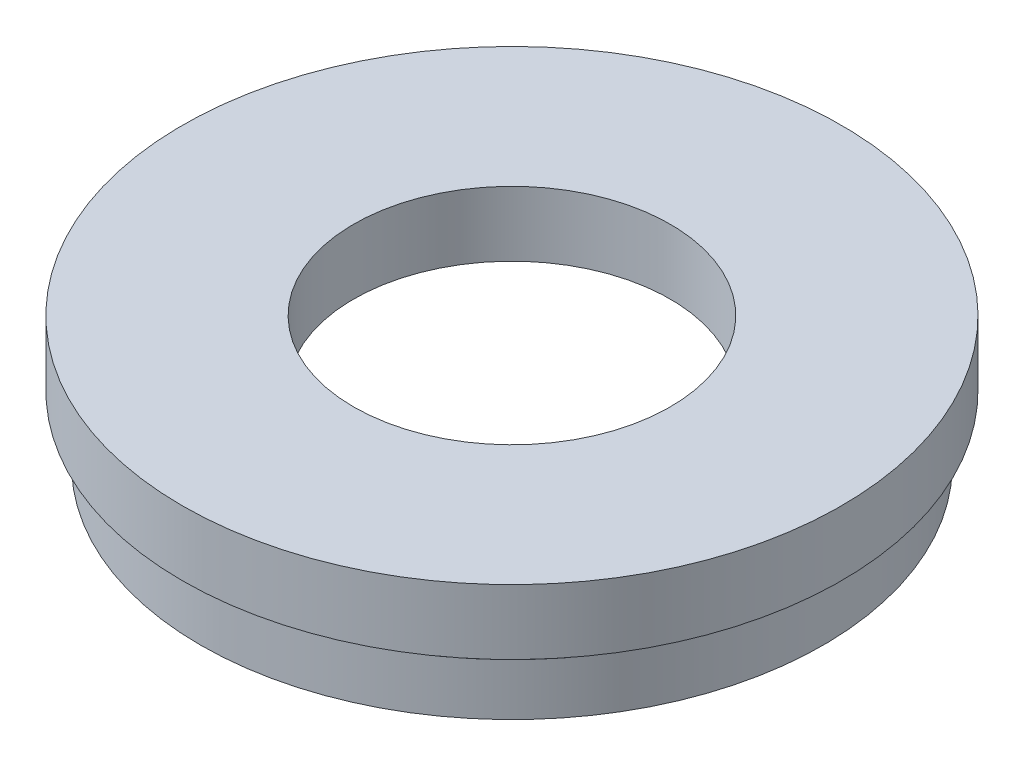
ISO-10303-21;
HEADER;
FILE_DESCRIPTION(('STEP AP214'),'2;1');
FILE_NAME('part.step','',(''),(''),'','','');
FILE_SCHEMA(('AUTOMOTIVE_DESIGN { 1 0 10303 214 1 1 1 1 }'));
ENDSEC;
DATA;
#1=APPLICATION_CONTEXT('core data for automotive mechanical design processes');
#2=APPLICATION_PROTOCOL_DEFINITION('international standard','automotive_design',2000,#1);
#3=PRODUCT_CONTEXT('',#1,'mechanical');
#4=PRODUCT('Part','Part','',(#3));
#5=PRODUCT_RELATED_PRODUCT_CATEGORY('part','',(#4));
#6=PRODUCT_DEFINITION_FORMATION('','',#4);
#7=PRODUCT_DEFINITION_CONTEXT('part definition',#1,'design');
#8=PRODUCT_DEFINITION('design','',#6,#7);
#9=PRODUCT_DEFINITION_SHAPE('','',#8);
#10=(LENGTH_UNIT() NAMED_UNIT(*) SI_UNIT(.MILLI.,.METRE.));
#11=(NAMED_UNIT(*) PLANE_ANGLE_UNIT() SI_UNIT($,.RADIAN.));
#12=(NAMED_UNIT(*) SI_UNIT($,.STERADIAN.) SOLID_ANGLE_UNIT());
#13=UNCERTAINTY_MEASURE_WITH_UNIT(LENGTH_MEASURE(1.E-05),#10,'distance_accuracy_value','');
#14=(GEOMETRIC_REPRESENTATION_CONTEXT(3) GLOBAL_UNCERTAINTY_ASSIGNED_CONTEXT((#13)) GLOBAL_UNIT_ASSIGNED_CONTEXT((#10,
#11,#12)) REPRESENTATION_CONTEXT('',''));
#15=CARTESIAN_POINT('',(0.,0.,0.));
#16=DIRECTION('',(0.,0.,1.));
#17=DIRECTION('',(1.,0.,0.));
#18=AXIS2_PLACEMENT_3D('',#15,#16,#17);
#19=CARTESIAN_POINT('',(20.5,0.,0.));
#20=DIRECTION('',(0.,1.,0.));
#21=DIRECTION('',(0.,0.,1.));
#22=AXIS2_PLACEMENT_3D('',#19,#20,#21);
#23=PLANE('',#22);
#24=CARTESIAN_POINT('',(0.,0.,0.));
#25=DIRECTION('',(0.,1.,0.));
#26=DIRECTION('',(0.,0.,1.));
#27=AXIS2_PLACEMENT_3D('',#24,#25,#26);
#28=CIRCLE('',#27,24.);
#29=CARTESIAN_POINT('',(0.,0.,24.));
#30=VERTEX_POINT('',#29);
#31=EDGE_CURVE('E10',#30,#30,#28,.T.);
#32=ORIENTED_EDGE('',*,*,#31,.F.);
#33=EDGE_LOOP('',(#32));
#34=FACE_BOUND('',#33,.T.);
#35=CARTESIAN_POINT('',(0.,0.,0.));
#36=DIRECTION('',(0.,1.,0.));
#37=DIRECTION('',(0.,0.,1.));
#38=AXIS2_PLACEMENT_3D('',#35,#36,#37);
#39=CIRCLE('',#38,20.5);
#40=CARTESIAN_POINT('',(0.,0.,20.5));
#41=VERTEX_POINT('',#40);
#42=EDGE_CURVE('E73',#41,#41,#39,.T.);
#43=ORIENTED_EDGE('',*,*,#42,.T.);
#44=EDGE_LOOP('',(#43));
#45=FACE_BOUND('',#44,.T.);
#46=ADVANCED_FACE('F33',(#34,#45),#23,.F.);
#47=CARTESIAN_POINT('',(0.,17.4192983181939,0.));
#48=DIRECTION('',(0.,1.,0.));
#49=DIRECTION('',(0.,0.,1.));
#50=AXIS2_PLACEMENT_3D('',#47,#48,#49);
#51=CYLINDRICAL_SURFACE('',#50,24.);
#52=CARTESIAN_POINT('',(0.,4.,0.));
#53=DIRECTION('',(0.,1.,0.));
#54=DIRECTION('',(0.,0.,1.));
#55=AXIS2_PLACEMENT_3D('',#52,#53,#54);
#56=CIRCLE('',#55,24.);
#57=CARTESIAN_POINT('',(0.,4.,24.));
#58=VERTEX_POINT('',#57);
#59=EDGE_CURVE('E39',#58,#58,#56,.T.);
#60=ORIENTED_EDGE('',*,*,#59,.F.);
#61=EDGE_LOOP('',(#60));
#62=FACE_BOUND('',#61,.T.);
#63=ORIENTED_EDGE('',*,*,#31,.T.);
#64=EDGE_LOOP('',(#63));
#65=FACE_BOUND('',#64,.T.);
#66=ADVANCED_FACE('F134',(#62,#65),#51,.T.);
#67=CARTESIAN_POINT('',(24.,4.,0.));
#68=DIRECTION('',(0.,-1.,0.));
#69=DIRECTION('',(0.,0.,-1.));
#70=AXIS2_PLACEMENT_3D('',#67,#68,#69);
#71=PLANE('',#70);
#72=CARTESIAN_POINT('',(0.,4.,0.));
#73=DIRECTION('',(0.,1.,0.));
#74=DIRECTION('',(0.,0.,1.));
#75=AXIS2_PLACEMENT_3D('',#72,#73,#74);
#76=CIRCLE('',#75,23.5);
#77=CARTESIAN_POINT('',(0.,4.,23.5));
#78=VERTEX_POINT('',#77);
#79=EDGE_CURVE('E43',#78,#78,#76,.T.);
#80=ORIENTED_EDGE('',*,*,#79,.F.);
#81=EDGE_LOOP('',(#80));
#82=FACE_BOUND('',#81,.T.);
#83=ORIENTED_EDGE('',*,*,#59,.T.);
#84=EDGE_LOOP('',(#83));
#85=FACE_BOUND('',#84,.T.);
#86=ADVANCED_FACE('F129',(#82,#85),#71,.F.);
#87=CARTESIAN_POINT('',(0.,17.4192983181939,0.));
#88=DIRECTION('',(0.,1.,0.));
#89=DIRECTION('',(0.,0.,1.));
#90=AXIS2_PLACEMENT_3D('',#87,#88,#89);
#91=CYLINDRICAL_SURFACE('',#90,23.5);
#92=CARTESIAN_POINT('',(0.,5.,0.));
#93=DIRECTION('',(0.,1.,0.));
#94=DIRECTION('',(0.,0.,1.));
#95=AXIS2_PLACEMENT_3D('',#92,#93,#94);
#96=CIRCLE('',#95,23.5);
#97=CARTESIAN_POINT('',(0.,5.,23.5));
#98=VERTEX_POINT('',#97);
#99=EDGE_CURVE('E47',#98,#98,#96,.T.);
#100=ORIENTED_EDGE('',*,*,#99,.F.);
#101=EDGE_LOOP('',(#100));
#102=FACE_BOUND('',#101,.T.);
#103=ORIENTED_EDGE('',*,*,#79,.T.);
#104=EDGE_LOOP('',(#103));
#105=FACE_BOUND('',#104,.T.);
#106=ADVANCED_FACE('F123',(#102,#105),#91,.T.);
#107=CARTESIAN_POINT('',(23.5,5.,0.));
#108=DIRECTION('',(0.,1.,0.));
#109=DIRECTION('',(0.,0.,1.));
#110=AXIS2_PLACEMENT_3D('',#107,#108,#109);
#111=PLANE('',#110);
#112=CARTESIAN_POINT('',(0.,5.,0.));
#113=DIRECTION('',(0.,1.,0.));
#114=DIRECTION('',(0.,0.,1.));
#115=AXIS2_PLACEMENT_3D('',#112,#113,#114);
#116=CIRCLE('',#115,25.4);
#117=CARTESIAN_POINT('',(0.,5.,25.4));
#118=VERTEX_POINT('',#117);
#119=EDGE_CURVE('E52',#118,#118,#116,.T.);
#120=ORIENTED_EDGE('',*,*,#119,.F.);
#121=EDGE_LOOP('',(#120));
#122=FACE_BOUND('',#121,.T.);
#123=ORIENTED_EDGE('',*,*,#99,.T.);
#124=EDGE_LOOP('',(#123));
#125=FACE_BOUND('',#124,.T.);
#126=ADVANCED_FACE('F117',(#122,#125),#111,.F.);
#127=CARTESIAN_POINT('',(0.,17.4192983181939,0.));
#128=DIRECTION('',(0.,1.,0.));
#129=DIRECTION('',(0.,0.,1.));
#130=AXIS2_PLACEMENT_3D('',#127,#128,#129);
#131=CYLINDRICAL_SURFACE('',#130,25.4);
#132=CARTESIAN_POINT('',(0.,10.,0.));
#133=DIRECTION('',(0.,1.,0.));
#134=DIRECTION('',(0.,0.,1.));
#135=AXIS2_PLACEMENT_3D('',#132,#133,#134);
#136=CIRCLE('',#135,25.4);
#137=CARTESIAN_POINT('',(0.,10.,25.4));
#138=VERTEX_POINT('',#137);
#139=EDGE_CURVE('E55',#138,#138,#136,.T.);
#140=ORIENTED_EDGE('',*,*,#139,.F.);
#141=EDGE_LOOP('',(#140));
#142=FACE_BOUND('',#141,.T.);
#143=ORIENTED_EDGE('',*,*,#119,.T.);
#144=EDGE_LOOP('',(#143));
#145=FACE_BOUND('',#144,.T.);
#146=ADVANCED_FACE('F111',(#142,#145),#131,.T.);
#147=CARTESIAN_POINT('',(12.2,10.,0.));
#148=DIRECTION('',(0.,-1.,0.));
#149=DIRECTION('',(0.,0.,-1.));
#150=AXIS2_PLACEMENT_3D('',#147,#148,#149);
#151=PLANE('',#150);
#152=CARTESIAN_POINT('',(0.,10.,0.));
#153=DIRECTION('',(0.,1.,0.));
#154=DIRECTION('',(0.,0.,1.));
#155=AXIS2_PLACEMENT_3D('',#152,#153,#154);
#156=CIRCLE('',#155,12.2);
#157=CARTESIAN_POINT('',(0.,10.,12.2));
#158=VERTEX_POINT('',#157);
#159=EDGE_CURVE('E58',#158,#158,#156,.T.);
#160=ORIENTED_EDGE('',*,*,#159,.F.);
#161=EDGE_LOOP('',(#160));
#162=FACE_BOUND('',#161,.T.);
#163=ORIENTED_EDGE('',*,*,#139,.T.);
#164=EDGE_LOOP('',(#163));
#165=FACE_BOUND('',#164,.T.);
#166=ADVANCED_FACE('F105',(#162,#165),#151,.F.);
#167=CARTESIAN_POINT('',(0.,17.4192983181939,0.));
#168=DIRECTION('',(0.,1.,0.));
#169=DIRECTION('',(0.,0.,1.));
#170=AXIS2_PLACEMENT_3D('',#167,#168,#169);
#171=CYLINDRICAL_SURFACE('',#170,12.2);
#172=CARTESIAN_POINT('',(0.,5.,0.));
#173=DIRECTION('',(0.,1.,0.));
#174=DIRECTION('',(0.,0.,1.));
#175=AXIS2_PLACEMENT_3D('',#172,#173,#174);
#176=CIRCLE('',#175,12.2);
#177=CARTESIAN_POINT('',(0.,5.,12.2));
#178=VERTEX_POINT('',#177);
#179=EDGE_CURVE('E61',#178,#178,#176,.T.);
#180=ORIENTED_EDGE('',*,*,#179,.F.);
#181=EDGE_LOOP('',(#180));
#182=FACE_BOUND('',#181,.T.);
#183=ORIENTED_EDGE('',*,*,#159,.T.);
#184=EDGE_LOOP('',(#183));
#185=FACE_BOUND('',#184,.T.);
#186=ADVANCED_FACE('F99',(#182,#185),#171,.F.);
#187=CARTESIAN_POINT('',(21.1,5.,0.));
#188=DIRECTION('',(0.,1.,0.));
#189=DIRECTION('',(0.,0.,1.));
#190=AXIS2_PLACEMENT_3D('',#187,#188,#189);
#191=PLANE('',#190);
#192=CARTESIAN_POINT('',(0.,5.,0.));
#193=DIRECTION('',(0.,1.,0.));
#194=DIRECTION('',(0.,0.,1.));
#195=AXIS2_PLACEMENT_3D('',#192,#193,#194);
#196=CIRCLE('',#195,21.1);
#197=CARTESIAN_POINT('',(0.,5.,21.1));
#198=VERTEX_POINT('',#197);
#199=EDGE_CURVE('E64',#198,#198,#196,.T.);
#200=ORIENTED_EDGE('',*,*,#199,.F.);
#201=EDGE_LOOP('',(#200));
#202=FACE_BOUND('',#201,.T.);
#203=ORIENTED_EDGE('',*,*,#179,.T.);
#204=EDGE_LOOP('',(#203));
#205=FACE_BOUND('',#204,.T.);
#206=ADVANCED_FACE('F93',(#202,#205),#191,.F.);
#207=CARTESIAN_POINT('',(0.,17.4192983181939,0.));
#208=DIRECTION('',(0.,1.,0.));
#209=DIRECTION('',(0.,0.,1.));
#210=AXIS2_PLACEMENT_3D('',#207,#208,#209);
#211=CYLINDRICAL_SURFACE('',#210,21.1);
#212=CARTESIAN_POINT('',(0.,4.,0.));
#213=DIRECTION('',(0.,1.,0.));
#214=DIRECTION('',(0.,0.,1.));
#215=AXIS2_PLACEMENT_3D('',#212,#213,#214);
#216=CIRCLE('',#215,21.1);
#217=CARTESIAN_POINT('',(0.,4.,21.1));
#218=VERTEX_POINT('',#217);
#219=EDGE_CURVE('E67',#218,#218,#216,.T.);
#220=ORIENTED_EDGE('',*,*,#219,.F.);
#221=EDGE_LOOP('',(#220));
#222=FACE_BOUND('',#221,.T.);
#223=ORIENTED_EDGE('',*,*,#199,.T.);
#224=EDGE_LOOP('',(#223));
#225=FACE_BOUND('',#224,.T.);
#226=ADVANCED_FACE('F87',(#222,#225),#211,.F.);
#227=CARTESIAN_POINT('',(20.5,4.,0.));
#228=DIRECTION('',(0.,-1.,0.));
#229=DIRECTION('',(0.,0.,-1.));
#230=AXIS2_PLACEMENT_3D('',#227,#228,#229);
#231=PLANE('',#230);
#232=CARTESIAN_POINT('',(0.,4.,0.));
#233=DIRECTION('',(0.,1.,0.));
#234=DIRECTION('',(0.,0.,1.));
#235=AXIS2_PLACEMENT_3D('',#232,#233,#234);
#236=CIRCLE('',#235,20.5);
#237=CARTESIAN_POINT('',(0.,4.,20.5));
#238=VERTEX_POINT('',#237);
#239=EDGE_CURVE('E70',#238,#238,#236,.T.);
#240=ORIENTED_EDGE('',*,*,#239,.F.);
#241=EDGE_LOOP('',(#240));
#242=FACE_BOUND('',#241,.T.);
#243=ORIENTED_EDGE('',*,*,#219,.T.);
#244=EDGE_LOOP('',(#243));
#245=FACE_BOUND('',#244,.T.);
#246=ADVANCED_FACE('F81',(#242,#245),#231,.F.);
#247=CARTESIAN_POINT('',(0.,17.4192983181939,0.));
#248=DIRECTION('',(0.,1.,0.));
#249=DIRECTION('',(0.,0.,1.));
#250=AXIS2_PLACEMENT_3D('',#247,#248,#249);
#251=CYLINDRICAL_SURFACE('',#250,20.5);
#252=ORIENTED_EDGE('',*,*,#42,.F.);
#253=EDGE_LOOP('',(#252));
#254=FACE_BOUND('',#253,.T.);
#255=ORIENTED_EDGE('',*,*,#239,.T.);
#256=EDGE_LOOP('',(#255));
#257=FACE_BOUND('',#256,.T.);
#258=ADVANCED_FACE('F78',(#254,#257),#251,.F.);
#259=CLOSED_SHELL('',(#46,#66,#86,#106,#126,#146,#166,#186,#206,#226,#246,#258));
#260=MANIFOLD_SOLID_BREP('B2',#259);
#261=ADVANCED_BREP_SHAPE_REPRESENTATION('',(#18,#260),#14);
#262=SHAPE_DEFINITION_REPRESENTATION(#9,#261);
ENDSEC;
END-ISO-10303-21;
